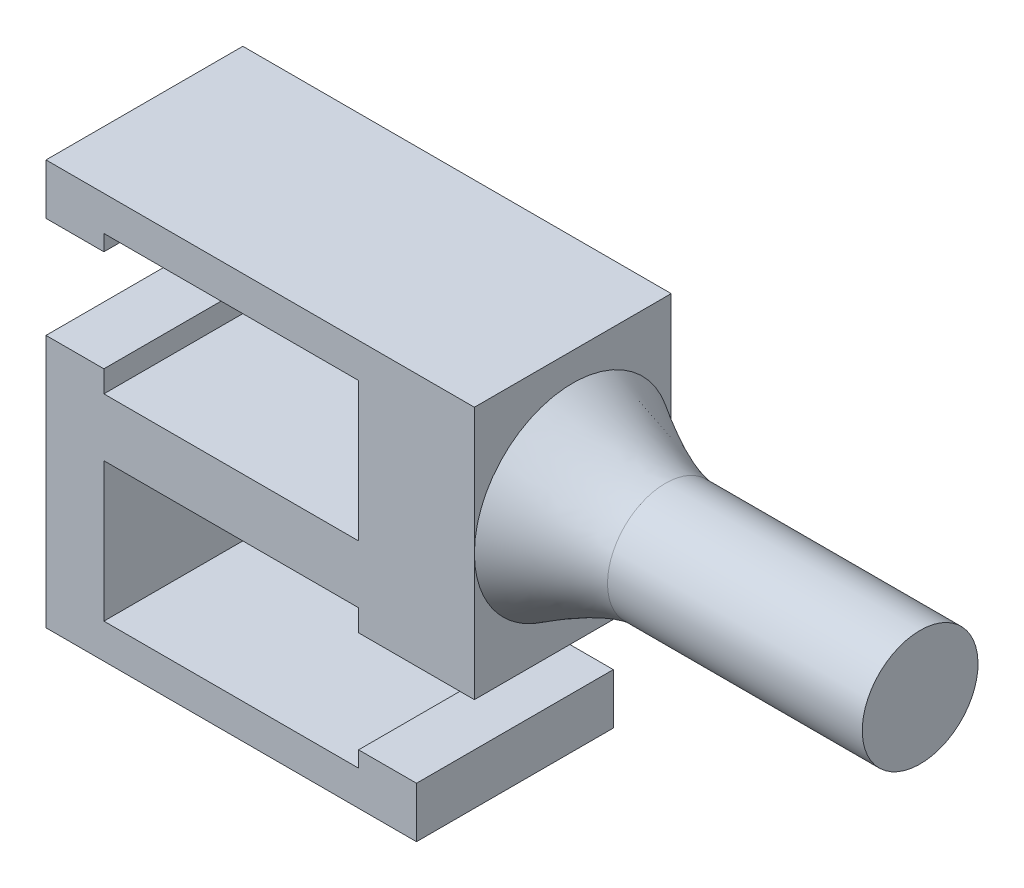
ISO-10303-21;
HEADER;
FILE_DESCRIPTION(('STEP AP214'),'2;1');
FILE_NAME('part.step','',(''),(''),'','','');
FILE_SCHEMA(('AUTOMOTIVE_DESIGN { 1 0 10303 214 1 1 1 1 }'));
ENDSEC;
DATA;
#1=APPLICATION_CONTEXT('core data for automotive mechanical design processes');
#2=APPLICATION_PROTOCOL_DEFINITION('international standard','automotive_design',2000,#1);
#3=PRODUCT_CONTEXT('',#1,'mechanical');
#4=PRODUCT('Part','Part','',(#3));
#5=PRODUCT_RELATED_PRODUCT_CATEGORY('part','',(#4));
#6=PRODUCT_DEFINITION_FORMATION('','',#4);
#7=PRODUCT_DEFINITION_CONTEXT('part definition',#1,'design');
#8=PRODUCT_DEFINITION('design','',#6,#7);
#9=PRODUCT_DEFINITION_SHAPE('','',#8);
#10=(LENGTH_UNIT() NAMED_UNIT(*) SI_UNIT(.MILLI.,.METRE.));
#11=(NAMED_UNIT(*) PLANE_ANGLE_UNIT() SI_UNIT($,.RADIAN.));
#12=(NAMED_UNIT(*) SI_UNIT($,.STERADIAN.) SOLID_ANGLE_UNIT());
#13=UNCERTAINTY_MEASURE_WITH_UNIT(LENGTH_MEASURE(1.E-05),#10,'distance_accuracy_value','');
#14=(GEOMETRIC_REPRESENTATION_CONTEXT(3) GLOBAL_UNCERTAINTY_ASSIGNED_CONTEXT((#13)) GLOBAL_UNIT_ASSIGNED_CONTEXT((#10,
#11,#12)) REPRESENTATION_CONTEXT('',''));
#15=CARTESIAN_POINT('',(0.,0.,0.));
#16=DIRECTION('',(0.,0.,1.));
#17=DIRECTION('',(1.,0.,0.));
#18=AXIS2_PLACEMENT_3D('',#15,#16,#17);
#19=CARTESIAN_POINT('',(21.1122382547684,0.,0.));
#20=DIRECTION('',(1.,0.,0.));
#21=DIRECTION('',(0.,1.,0.));
#22=AXIS2_PLACEMENT_3D('',#19,#20,#21);
#23=PLANE('',#22);
#24=DIRECTION('',(0.,1.,0.));
#25=VECTOR('',#24,1.);
#26=CARTESIAN_POINT('',(21.1122382547684,75.9799365132959,32.));
#27=LINE('',#26,#25);
#28=CARTESIAN_POINT('',(21.1122382547684,54.1049365132959,32.));
#29=VERTEX_POINT('',#28);
#30=CARTESIAN_POINT('',(21.1122382547684,65.0421631936669,32.));
#31=VERTEX_POINT('',#30);
#32=EDGE_CURVE('E222',#29,#31,#27,.T.);
#33=ORIENTED_EDGE('',*,*,#32,.F.);
#34=DIRECTION('',(0.,0.,1.));
#35=VECTOR('',#34,1.);
#36=CARTESIAN_POINT('',(21.1122382547684,54.1049365132959,15.));
#37=LINE('',#36,#35);
#38=CARTESIAN_POINT('',(21.1122382547684,54.1049365132959,15.));
#39=VERTEX_POINT('',#38);
#40=EDGE_CURVE('E205',#39,#29,#37,.T.);
#41=ORIENTED_EDGE('',*,*,#40,.F.);
#42=DIRECTION('',(0.,-1.,0.));
#43=VECTOR('',#42,1.);
#44=CARTESIAN_POINT('',(21.1122382547684,75.9799365132959,15.));
#45=LINE('',#44,#43);
#46=CARTESIAN_POINT('',(21.1122382547684,65.0427098329382,15.));
#47=VERTEX_POINT('',#46);
#48=EDGE_CURVE('E199',#47,#39,#45,.T.);
#49=ORIENTED_EDGE('',*,*,#48,.F.);
#50=CARTESIAN_POINT('',(21.1122382547684,72.8146764351576,20.0587376448433));
#51=CARTESIAN_POINT('',(21.1122382547684,79.697201145471,35.6032174885667));
#52=CARTESIAN_POINT('',(21.1122382547684,64.1527213017475,42.4857421988802));
#53=CARTESIAN_POINT('',(21.1122382547684,57.2701965914341,26.9412623551567));
#54=CARTESIAN_POINT('',(21.1122382547684,50.3876718811207,11.3967825114333));
#55=CARTESIAN_POINT('',(21.1122382547684,65.9321517248442,4.51425780111984));
#56=CARTESIAN_POINT('',(21.1122382547684,72.8146764351576,20.0587376448433));
#57=(BOUNDED_CURVE() B_SPLINE_CURVE(3,(#50,#51,#52,#53,#54,#55,#56),.UNSPECIFIED.,.T.,
.F.) B_SPLINE_CURVE_WITH_KNOTS((4,3,4),(0.,0.5,1.),
.UNSPECIFIED.) CURVE() GEOMETRIC_REPRESENTATION_ITEM() RATIONAL_B_SPLINE_CURVE((1.,
0.333333333333333,0.333333333333333,1.,0.333333333333333,0.333333333333333,1.)) REPRESENTATION_ITEM(''));
#58=EDGE_CURVE('E191',#47,#31,#57,.F.);
#59=ORIENTED_EDGE('',*,*,#58,.T.);
#60=EDGE_LOOP('',(#33,#41,#49,#59));
#61=FACE_BOUND('',#60,.T.);
#62=ADVANCED_FACE('F41',(#61),#23,.T.);
#63=CARTESIAN_POINT('',(21.1122382547684,75.9799365132959,15.));
#64=VERTEX_POINT('',#63);
#65=EDGE_CURVE('E187',#64,#47,#45,.T.);
#66=ORIENTED_EDGE('',*,*,#65,.F.);
#67=DIRECTION('',(0.,0.,-1.));
#68=VECTOR('',#67,1.);
#69=CARTESIAN_POINT('',(21.1122382547684,75.9799365132959,15.));
#70=LINE('',#69,#68);
#71=CARTESIAN_POINT('',(21.1122382547684,75.9799365132959,32.));
#72=VERTEX_POINT('',#71);
#73=EDGE_CURVE('E231',#72,#64,#70,.T.);
#74=ORIENTED_EDGE('',*,*,#73,.F.);
#75=EDGE_CURVE('E189',#31,#72,#27,.T.);
#76=ORIENTED_EDGE('',*,*,#75,.F.);
#77=CARTESIAN_POINT('',(21.1122382547684,65.0424365132959,23.5));
#78=DIRECTION('',(-1.,0.,0.));
#79=DIRECTION('',(0.,1.,0.));
#80=AXIS2_PLACEMENT_3D('',#77,#78,#79);
#81=CIRCLE('',#80,8.49999999999999);
#82=EDGE_CURVE('E57',#31,#47,#81,.T.);
#83=ORIENTED_EDGE('',*,*,#82,.T.);
#84=EDGE_LOOP('',(#66,#74,#76,#83));
#85=FACE_BOUND('',#84,.T.);
#86=ADVANCED_FACE('F185',(#85),#23,.T.);
#87=CARTESIAN_POINT('',(16.1122382547684,0.,35.));
#88=DIRECTION('',(-1.,0.,0.));
#89=DIRECTION('',(0.,-1.,0.));
#90=AXIS2_PLACEMENT_3D('',#87,#88,#89);
#91=PLANE('',#90);
#92=DIRECTION('',(0.,0.,-1.));
#93=VECTOR('',#92,1.);
#94=CARTESIAN_POINT('',(16.1122382547684,40.9799365132959,35.));
#95=LINE('',#94,#93);
#96=CARTESIAN_POINT('',(16.1122382547684,40.9799365132959,32.));
#97=VERTEX_POINT('',#96);
#98=CARTESIAN_POINT('',(16.1122382547684,40.9799365132959,15.));
#99=VERTEX_POINT('',#98);
#100=EDGE_CURVE('E50',#97,#99,#95,.T.);
#101=ORIENTED_EDGE('',*,*,#100,.T.);
#102=DIRECTION('',(0.,1.,0.));
#103=VECTOR('',#102,1.);
#104=CARTESIAN_POINT('',(16.1122382547684,75.9799365132959,15.));
#105=LINE('',#104,#103);
#106=CARTESIAN_POINT('',(16.1122382547684,45.3549365132959,15.));
#107=VERTEX_POINT('',#106);
#108=EDGE_CURVE('E406',#99,#107,#105,.T.);
#109=ORIENTED_EDGE('',*,*,#108,.T.);
#110=DIRECTION('',(0.,0.,1.));
#111=VECTOR('',#110,1.);
#112=CARTESIAN_POINT('',(16.1122382547684,45.3549365132959,35.));
#113=LINE('',#112,#111);
#114=CARTESIAN_POINT('',(16.1122382547684,45.3549365132959,32.));
#115=VERTEX_POINT('',#114);
#116=EDGE_CURVE('E382',#107,#115,#113,.T.);
#117=ORIENTED_EDGE('',*,*,#116,.T.);
#118=DIRECTION('',(0.,1.,0.));
#119=VECTOR('',#118,1.);
#120=CARTESIAN_POINT('',(16.1122382547684,75.9799365132959,32.));
#121=LINE('',#120,#119);
#122=EDGE_CURVE('E475',#97,#115,#121,.T.);
#123=ORIENTED_EDGE('',*,*,#122,.F.);
#124=EDGE_LOOP('',(#101,#109,#117,#123));
#125=FACE_BOUND('',#124,.T.);
#126=ADVANCED_FACE('F287',(#125),#91,.F.);
#127=CARTESIAN_POINT('',(11.1122380163498,0.,35.));
#128=DIRECTION('',(-1.,0.,0.));
#129=DIRECTION('',(0.,0.,-1.));
#130=AXIS2_PLACEMENT_3D('',#127,#128,#129);
#131=PLANE('',#130);
#132=DIRECTION('',(0.,1.,0.));
#133=VECTOR('',#132,1.);
#134=CARTESIAN_POINT('',(11.1122380163498,0.,32.));
#135=LINE('',#134,#133);
#136=CARTESIAN_POINT('',(11.1122380163498,43.9799365132959,32.));
#137=VERTEX_POINT('',#136);
#138=CARTESIAN_POINT('',(11.1122380163498,45.3549365132959,32.));
#139=VERTEX_POINT('',#138);
#140=EDGE_CURVE('E340',#137,#139,#135,.T.);
#141=ORIENTED_EDGE('',*,*,#140,.T.);
#142=DIRECTION('',(0.,0.,1.));
#143=VECTOR('',#142,1.);
#144=CARTESIAN_POINT('',(11.1122380163498,45.3549365132959,35.));
#145=LINE('',#144,#143);
#146=CARTESIAN_POINT('',(11.1122380163498,45.3549365132959,15.));
#147=VERTEX_POINT('',#146);
#148=EDGE_CURVE('E383',#147,#139,#145,.T.);
#149=ORIENTED_EDGE('',*,*,#148,.F.);
#150=DIRECTION('',(0.,-1.,0.));
#151=VECTOR('',#150,1.);
#152=CARTESIAN_POINT('',(11.1122380163498,0.,15.));
#153=LINE('',#152,#151);
#154=CARTESIAN_POINT('',(11.1122380163498,43.9799365132959,15.));
#155=VERTEX_POINT('',#154);
#156=EDGE_CURVE('E346',#147,#155,#153,.T.);
#157=ORIENTED_EDGE('',*,*,#156,.T.);
#158=DIRECTION('',(0.,0.,-1.));
#159=VECTOR('',#158,1.);
#160=CARTESIAN_POINT('',(11.1122380163498,43.9799365132959,35.));
#161=LINE('',#160,#159);
#162=EDGE_CURVE('E334',#137,#155,#161,.T.);
#163=ORIENTED_EDGE('',*,*,#162,.F.);
#164=EDGE_LOOP('',(#141,#149,#157,#163));
#165=FACE_BOUND('',#164,.T.);
#166=ADVANCED_FACE('F290',(#165),#131,.T.);
#167=CARTESIAN_POINT('',(-10.8877619836502,0.,35.));
#168=DIRECTION('',(-1.,0.,0.));
#169=DIRECTION('',(0.,-1.,0.));
#170=AXIS2_PLACEMENT_3D('',#167,#168,#169);
#171=PLANE('',#170);
#172=DIRECTION('',(0.,0.,-1.));
#173=VECTOR('',#172,1.);
#174=CARTESIAN_POINT('',(-10.8877619836502,60.9799365132958,35.));
#175=LINE('',#174,#173);
#176=CARTESIAN_POINT('',(-10.8877619836502,60.9799365132958,32.));
#177=VERTEX_POINT('',#176);
#178=CARTESIAN_POINT('',(-10.8877619836502,60.9799365132959,15.));
#179=VERTEX_POINT('',#178);
#180=EDGE_CURVE('E451',#177,#179,#175,.T.);
#181=ORIENTED_EDGE('',*,*,#180,.T.);
#182=DIRECTION('',(0.,-1.,0.));
#183=VECTOR('',#182,1.);
#184=CARTESIAN_POINT('',(-10.8877619836502,0.,15.));
#185=LINE('',#184,#183);
#186=CARTESIAN_POINT('',(-10.8877619836502,62.8549365132958,15.));
#187=VERTEX_POINT('',#186);
#188=EDGE_CURVE('E439',#187,#179,#185,.T.);
#189=ORIENTED_EDGE('',*,*,#188,.F.);
#190=DIRECTION('',(0.,0.,-1.));
#191=VECTOR('',#190,1.);
#192=CARTESIAN_POINT('',(-10.8877619836502,62.8549365132958,15.));
#193=LINE('',#192,#191);
#194=CARTESIAN_POINT('',(-10.8877619836502,62.8549365132958,32.));
#195=VERTEX_POINT('',#194);
#196=EDGE_CURVE('E393',#195,#187,#193,.T.);
#197=ORIENTED_EDGE('',*,*,#196,.F.);
#198=DIRECTION('',(0.,1.,0.));
#199=VECTOR('',#198,1.);
#200=CARTESIAN_POINT('',(-10.8877619836502,0.,32.));
#201=LINE('',#200,#199);
#202=EDGE_CURVE('E367',#177,#195,#201,.T.);
#203=ORIENTED_EDGE('',*,*,#202,.F.);
#204=EDGE_LOOP('',(#181,#189,#197,#203));
#205=FACE_BOUND('',#204,.T.);
#206=ADVANCED_FACE('F319',(#205),#171,.F.);
#207=CARTESIAN_POINT('',(-15.8877622220688,0.,35.));
#208=DIRECTION('',(-1.,0.,0.));
#209=DIRECTION('',(0.,-1.,0.));
#210=AXIS2_PLACEMENT_3D('',#207,#208,#209);
#211=PLANE('',#210);
#212=DIRECTION('',(0.,1.,0.));
#213=VECTOR('',#212,1.);
#214=CARTESIAN_POINT('',(-15.8877622220688,75.9799365132959,32.));
#215=LINE('',#214,#213);
#216=CARTESIAN_POINT('',(-15.8877622220688,40.9799365132959,32.));
#217=VERTEX_POINT('',#216);
#218=CARTESIAN_POINT('',(-15.8877622220688,62.8549365132958,32.));
#219=VERTEX_POINT('',#218);
#220=EDGE_CURVE('E471',#217,#219,#215,.T.);
#221=ORIENTED_EDGE('',*,*,#220,.T.);
#222=DIRECTION('',(0.,0.,1.));
#223=VECTOR('',#222,1.);
#224=CARTESIAN_POINT('',(-15.8877622220688,62.8549365132958,15.));
#225=LINE('',#224,#223);
#226=CARTESIAN_POINT('',(-15.8877622220688,62.8549365132958,15.));
#227=VERTEX_POINT('',#226);
#228=EDGE_CURVE('E399',#227,#219,#225,.T.);
#229=ORIENTED_EDGE('',*,*,#228,.F.);
#230=DIRECTION('',(0.,1.,0.));
#231=VECTOR('',#230,1.);
#232=CARTESIAN_POINT('',(-15.8877622220688,75.9799365132959,15.));
#233=LINE('',#232,#231);
#234=CARTESIAN_POINT('',(-15.8877622220688,40.9799365132959,15.));
#235=VERTEX_POINT('',#234);
#236=EDGE_CURVE('E410',#235,#227,#233,.T.);
#237=ORIENTED_EDGE('',*,*,#236,.F.);
#238=DIRECTION('',(0.,0.,-1.));
#239=VECTOR('',#238,1.);
#240=CARTESIAN_POINT('',(-15.8877622220688,40.9799365132959,35.));
#241=LINE('',#240,#239);
#242=EDGE_CURVE('E446',#217,#235,#241,.T.);
#243=ORIENTED_EDGE('',*,*,#242,.F.);
#244=EDGE_LOOP('',(#221,#229,#237,#243));
#245=FACE_BOUND('',#244,.T.);
#246=ADVANCED_FACE('F286',(#245),#211,.T.);
#247=CARTESIAN_POINT('',(-15.8877622220688,75.9799365132959,15.));
#248=DIRECTION('',(0.,0.,1.));
#249=DIRECTION('',(0.,1.,0.));
#250=AXIS2_PLACEMENT_3D('',#247,#248,#249);
#251=PLANE('',#250);
#252=ORIENTED_EDGE('',*,*,#108,.F.);
#253=DIRECTION('',(1.,0.,0.));
#254=VECTOR('',#253,1.);
#255=CARTESIAN_POINT('',(-15.8877622220688,40.9799365132959,15.));
#256=LINE('',#255,#254);
#257=EDGE_CURVE('E416',#235,#99,#256,.T.);
#258=ORIENTED_EDGE('',*,*,#257,.F.);
#259=ORIENTED_EDGE('',*,*,#236,.T.);
#260=DIRECTION('',(-1.,0.,0.));
#261=VECTOR('',#260,1.);
#262=CARTESIAN_POINT('',(16.1132382547684,62.8549365132958,15.));
#263=LINE('',#262,#261);
#264=EDGE_CURVE('E402',#187,#227,#263,.T.);
#265=ORIENTED_EDGE('',*,*,#264,.F.);
#266=ORIENTED_EDGE('',*,*,#188,.T.);
#267=DIRECTION('',(1.,0.,0.));
#268=VECTOR('',#267,1.);
#269=CARTESIAN_POINT('',(0.,60.9799365132959,15.));
#270=LINE('',#269,#268);
#271=CARTESIAN_POINT('',(11.1122380163498,60.9799365132958,15.));
#272=VERTEX_POINT('',#271);
#273=EDGE_CURVE('E436',#179,#272,#270,.T.);
#274=ORIENTED_EDGE('',*,*,#273,.T.);
#275=DIRECTION('',(0.,-1.,0.));
#276=VECTOR('',#275,1.);
#277=CARTESIAN_POINT('',(11.1122380163498,0.,15.));
#278=LINE('',#277,#276);
#279=CARTESIAN_POINT('',(11.1122380163498,72.9799365132958,15.));
#280=VERTEX_POINT('',#279);
#281=EDGE_CURVE('E433',#280,#272,#278,.T.);
#282=ORIENTED_EDGE('',*,*,#281,.F.);
#283=DIRECTION('',(-1.,4.06395371900136E-09,0.));
#284=VECTOR('',#283,1.);
#285=CARTESIAN_POINT('',(2.96587084589218E-07,72.9799365584555,15.));
#286=LINE('',#285,#284);
#287=CARTESIAN_POINT('',(-10.8877619836502,72.9799366027028,15.));
#288=VERTEX_POINT('',#287);
#289=EDGE_CURVE('E430',#280,#288,#286,.T.);
#290=ORIENTED_EDGE('',*,*,#289,.T.);
#291=CARTESIAN_POINT('',(-10.8877619836502,71.6049365132959,15.));
#292=VERTEX_POINT('',#291);
#293=EDGE_CURVE('E440',#288,#292,#185,.T.);
#294=ORIENTED_EDGE('',*,*,#293,.T.);
#295=DIRECTION('',(-1.,0.,0.));
#296=VECTOR('',#295,1.);
#297=CARTESIAN_POINT('',(16.1132382547684,71.6049365132959,15.));
#298=LINE('',#297,#296);
#299=CARTESIAN_POINT('',(-15.8877622220688,71.6049365132959,15.));
#300=VERTEX_POINT('',#299);
#301=EDGE_CURVE('E398',#292,#300,#298,.T.);
#302=ORIENTED_EDGE('',*,*,#301,.T.);
#303=CARTESIAN_POINT('',(-15.8877622220688,75.9799365132959,15.));
#304=VERTEX_POINT('',#303);
#305=EDGE_CURVE('E413',#300,#304,#233,.T.);
#306=ORIENTED_EDGE('',*,*,#305,.T.);
#307=DIRECTION('',(1.,0.,0.));
#308=VECTOR('',#307,1.);
#309=CARTESIAN_POINT('',(-15.8877622220688,75.9799365132959,15.));
#310=LINE('',#309,#308);
#311=EDGE_CURVE('E203',#304,#64,#310,.T.);
#312=ORIENTED_EDGE('',*,*,#311,.T.);
#313=ORIENTED_EDGE('',*,*,#65,.T.);
#314=ORIENTED_EDGE('',*,*,#48,.T.);
#315=DIRECTION('',(1.,0.,0.));
#316=VECTOR('',#315,1.);
#317=CARTESIAN_POINT('',(-15.8887622220688,54.1049365132958,15.));
#318=LINE('',#317,#316);
#319=CARTESIAN_POINT('',(11.1122380163498,54.1049365132959,15.));
#320=VERTEX_POINT('',#319);
#321=EDGE_CURVE('E389',#320,#39,#318,.T.);
#322=ORIENTED_EDGE('',*,*,#321,.F.);
#323=CARTESIAN_POINT('',(11.1122380163498,55.9799365132959,15.));
#324=VERTEX_POINT('',#323);
#325=EDGE_CURVE('E422',#324,#320,#153,.T.);
#326=ORIENTED_EDGE('',*,*,#325,.F.);
#327=DIRECTION('',(-1.,0.,0.));
#328=VECTOR('',#327,1.);
#329=CARTESIAN_POINT('',(0.,55.9799365132959,15.));
#330=LINE('',#329,#328);
#331=CARTESIAN_POINT('',(-10.8877619836502,55.9799365132959,15.));
#332=VERTEX_POINT('',#331);
#333=EDGE_CURVE('E418',#324,#332,#330,.T.);
#334=ORIENTED_EDGE('',*,*,#333,.T.);
#335=DIRECTION('',(0.,-1.,0.));
#336=VECTOR('',#335,1.);
#337=CARTESIAN_POINT('',(-10.8877619836502,0.,15.));
#338=LINE('',#337,#336);
#339=CARTESIAN_POINT('',(-10.8877619836502,43.9799365132959,15.));
#340=VERTEX_POINT('',#339);
#341=EDGE_CURVE('E427',#332,#340,#338,.T.);
#342=ORIENTED_EDGE('',*,*,#341,.T.);
#343=DIRECTION('',(-1.,0.,0.));
#344=VECTOR('',#343,1.);
#345=CARTESIAN_POINT('',(0.,43.9799365132959,15.));
#346=LINE('',#345,#344);
#347=EDGE_CURVE('E425',#155,#340,#346,.T.);
#348=ORIENTED_EDGE('',*,*,#347,.F.);
#349=ORIENTED_EDGE('',*,*,#156,.F.);
#350=DIRECTION('',(1.,0.,0.));
#351=VECTOR('',#350,1.);
#352=CARTESIAN_POINT('',(-15.8887622220688,45.3549365132958,15.));
#353=LINE('',#352,#351);
#354=EDGE_CURVE('E391',#147,#107,#353,.T.);
#355=ORIENTED_EDGE('',*,*,#354,.T.);
#356=EDGE_LOOP('',(#252,#258,#259,#265,#266,#274,#282,#290,#294,#302,#306,#312,#313,#314,#322,
#326,#334,#342,#348,#349,#355));
#357=FACE_BOUND('',#356,.T.);
#358=ADVANCED_FACE('F196',(#357),#251,.F.);
#359=CARTESIAN_POINT('',(0.,75.9799365132959,35.));
#360=DIRECTION('',(0.,1.,0.));
#361=DIRECTION('',(0.,0.,-1.));
#362=AXIS2_PLACEMENT_3D('',#359,#360,#361);
#363=PLANE('',#362);
#364=DIRECTION('',(-1.,0.,0.));
#365=VECTOR('',#364,1.);
#366=CARTESIAN_POINT('',(16.1122382547684,75.9799365132959,32.));
#367=LINE('',#366,#365);
#368=CARTESIAN_POINT('',(-15.8877622220688,75.9799365132959,32.));
#369=VERTEX_POINT('',#368);
#370=EDGE_CURVE('E350',#72,#369,#367,.T.);
#371=ORIENTED_EDGE('',*,*,#370,.F.);
#372=ORIENTED_EDGE('',*,*,#73,.T.);
#373=ORIENTED_EDGE('',*,*,#311,.F.);
#374=DIRECTION('',(0.,0.,-1.));
#375=VECTOR('',#374,1.);
#376=CARTESIAN_POINT('',(-15.8877622220688,75.9799365132959,35.));
#377=LINE('',#376,#375);
#378=EDGE_CURVE('E449',#369,#304,#377,.T.);
#379=ORIENTED_EDGE('',*,*,#378,.F.);
#380=EDGE_LOOP('',(#371,#372,#373,#379));
#381=FACE_BOUND('',#380,.T.);
#382=ADVANCED_FACE('F285',(#381),#363,.T.);
#383=CARTESIAN_POINT('',(0.,40.9799365132959,35.));
#384=DIRECTION('',(0.,1.,0.));
#385=DIRECTION('',(0.,0.,-1.));
#386=AXIS2_PLACEMENT_3D('',#383,#384,#385);
#387=PLANE('',#386);
#388=ORIENTED_EDGE('',*,*,#242,.T.);
#389=ORIENTED_EDGE('',*,*,#257,.T.);
#390=ORIENTED_EDGE('',*,*,#100,.F.);
#391=DIRECTION('',(-1.,0.,0.));
#392=VECTOR('',#391,1.);
#393=CARTESIAN_POINT('',(16.1122382547684,40.9799365132959,32.));
#394=LINE('',#393,#392);
#395=EDGE_CURVE('E353',#97,#217,#394,.T.);
#396=ORIENTED_EDGE('',*,*,#395,.T.);
#397=EDGE_LOOP('',(#388,#389,#390,#396));
#398=FACE_BOUND('',#397,.T.);
#399=ADVANCED_FACE('F292',(#398),#387,.F.);
#400=DIRECTION('',(0.,0.,-1.));
#401=VECTOR('',#400,1.);
#402=CARTESIAN_POINT('',(-10.8877619836502,71.6049365132959,15.));
#403=LINE('',#402,#401);
#404=CARTESIAN_POINT('',(-10.8877619836502,71.6049365132959,32.));
#405=VERTEX_POINT('',#404);
#406=EDGE_CURVE('E397',#405,#292,#403,.T.);
#407=ORIENTED_EDGE('',*,*,#406,.T.);
#408=ORIENTED_EDGE('',*,*,#293,.F.);
#409=DIRECTION('',(0.,0.,-1.));
#410=VECTOR('',#409,1.);
#411=CARTESIAN_POINT('',(-10.8877619836502,72.9799366027028,35.));
#412=LINE('',#411,#410);
#413=CARTESIAN_POINT('',(-10.8877619836502,72.9799366027028,32.));
#414=VERTEX_POINT('',#413);
#415=EDGE_CURVE('E458',#414,#288,#412,.T.);
#416=ORIENTED_EDGE('',*,*,#415,.F.);
#417=DIRECTION('',(0.,1.,0.));
#418=VECTOR('',#417,1.);
#419=CARTESIAN_POINT('',(-10.8877619836502,0.,32.));
#420=LINE('',#419,#418);
#421=EDGE_CURVE('E377',#405,#414,#420,.T.);
#422=ORIENTED_EDGE('',*,*,#421,.F.);
#423=EDGE_LOOP('',(#407,#408,#416,#422));
#424=FACE_BOUND('',#423,.T.);
#425=ADVANCED_FACE('F295',(#424),#171,.F.);
#426=CARTESIAN_POINT('',(0.,60.9799365132959,35.));
#427=DIRECTION('',(0.,-1.,0.));
#428=DIRECTION('',(1.,0.,0.));
#429=AXIS2_PLACEMENT_3D('',#426,#427,#428);
#430=PLANE('',#429);
#431=DIRECTION('',(0.,0.,-1.));
#432=VECTOR('',#431,1.);
#433=CARTESIAN_POINT('',(11.1122380163498,60.9799365132958,35.));
#434=LINE('',#433,#432);
#435=CARTESIAN_POINT('',(11.1122380163498,60.9799365132958,32.));
#436=VERTEX_POINT('',#435);
#437=EDGE_CURVE('E454',#436,#272,#434,.T.);
#438=ORIENTED_EDGE('',*,*,#437,.T.);
#439=ORIENTED_EDGE('',*,*,#273,.F.);
#440=ORIENTED_EDGE('',*,*,#180,.F.);
#441=DIRECTION('',(-1.,0.,0.));
#442=VECTOR('',#441,1.);
#443=CARTESIAN_POINT('',(0.,60.9799365132959,32.));
#444=LINE('',#443,#442);
#445=EDGE_CURVE('E370',#436,#177,#444,.T.);
#446=ORIENTED_EDGE('',*,*,#445,.F.);
#447=EDGE_LOOP('',(#438,#439,#440,#446));
#448=FACE_BOUND('',#447,.T.);
#449=ADVANCED_FACE('F303',(#448),#430,.F.);
#450=DIRECTION('',(0.,1.,0.));
#451=VECTOR('',#450,1.);
#452=CARTESIAN_POINT('',(11.1122380163498,0.,32.));
#453=LINE('',#452,#451);
#454=CARTESIAN_POINT('',(11.1122380163498,72.9799365132958,32.));
#455=VERTEX_POINT('',#454);
#456=EDGE_CURVE('E372',#436,#455,#453,.T.);
#457=ORIENTED_EDGE('',*,*,#456,.T.);
#458=DIRECTION('',(0.,0.,-1.));
#459=VECTOR('',#458,1.);
#460=CARTESIAN_POINT('',(11.1122380163498,72.9799365132958,35.));
#461=LINE('',#460,#459);
#462=EDGE_CURVE('E456',#455,#280,#461,.T.);
#463=ORIENTED_EDGE('',*,*,#462,.T.);
#464=ORIENTED_EDGE('',*,*,#281,.T.);
#465=ORIENTED_EDGE('',*,*,#437,.F.);
#466=EDGE_LOOP('',(#457,#463,#464,#465));
#467=FACE_BOUND('',#466,.T.);
#468=ADVANCED_FACE('F306',(#467),#131,.T.);
#469=DIRECTION('',(0.,0.,-1.));
#470=VECTOR('',#469,1.);
#471=CARTESIAN_POINT('',(-10.8877619836502,43.9799365132959,35.));
#472=LINE('',#471,#470);
#473=CARTESIAN_POINT('',(-10.8877619836502,43.9799365132959,32.));
#474=VERTEX_POINT('',#473);
#475=EDGE_CURVE('E336',#474,#340,#472,.T.);
#476=ORIENTED_EDGE('',*,*,#475,.T.);
#477=ORIENTED_EDGE('',*,*,#341,.F.);
#478=DIRECTION('',(0.,0.,-1.));
#479=VECTOR('',#478,1.);
#480=CARTESIAN_POINT('',(-10.8877619836502,55.9799365132959,35.));
#481=LINE('',#480,#479);
#482=CARTESIAN_POINT('',(-10.8877619836502,55.9799365132959,32.));
#483=VERTEX_POINT('',#482);
#484=EDGE_CURVE('E443',#483,#332,#481,.T.);
#485=ORIENTED_EDGE('',*,*,#484,.F.);
#486=DIRECTION('',(0.,1.,0.));
#487=VECTOR('',#486,1.);
#488=CARTESIAN_POINT('',(-10.8877619836502,0.,32.));
#489=LINE('',#488,#487);
#490=EDGE_CURVE('E339',#474,#483,#489,.T.);
#491=ORIENTED_EDGE('',*,*,#490,.F.);
#492=EDGE_LOOP('',(#476,#477,#485,#491));
#493=FACE_BOUND('',#492,.T.);
#494=ADVANCED_FACE('F310',(#493),#171,.F.);
#495=CARTESIAN_POINT('',(0.,43.9799365132959,35.));
#496=DIRECTION('',(0.,1.,0.));
#497=DIRECTION('',(0.,0.,-1.));
#498=AXIS2_PLACEMENT_3D('',#495,#496,#497);
#499=PLANE('',#498);
#500=DIRECTION('',(1.,0.,0.));
#501=VECTOR('',#500,1.);
#502=CARTESIAN_POINT('',(0.,43.9799365132959,32.));
#503=LINE('',#502,#501);
#504=EDGE_CURVE('E331',#474,#137,#503,.T.);
#505=ORIENTED_EDGE('',*,*,#504,.T.);
#506=ORIENTED_EDGE('',*,*,#162,.T.);
#507=ORIENTED_EDGE('',*,*,#347,.T.);
#508=ORIENTED_EDGE('',*,*,#475,.F.);
#509=EDGE_LOOP('',(#505,#506,#507,#508));
#510=FACE_BOUND('',#509,.T.);
#511=ADVANCED_FACE('F320',(#510),#499,.T.);
#512=DIRECTION('',(0.,1.,0.));
#513=VECTOR('',#512,1.);
#514=CARTESIAN_POINT('',(11.1122380163498,0.,32.));
#515=LINE('',#514,#513);
#516=CARTESIAN_POINT('',(11.1122380163498,54.1049365132959,32.));
#517=VERTEX_POINT('',#516);
#518=CARTESIAN_POINT('',(11.1122380163498,55.9799365132959,32.));
#519=VERTEX_POINT('',#518);
#520=EDGE_CURVE('E360',#517,#519,#515,.T.);
#521=ORIENTED_EDGE('',*,*,#520,.T.);
#522=DIRECTION('',(0.,0.,-1.));
#523=VECTOR('',#522,1.);
#524=CARTESIAN_POINT('',(11.1122380163498,55.9799365132959,35.));
#525=LINE('',#524,#523);
#526=EDGE_CURVE('E347',#519,#324,#525,.T.);
#527=ORIENTED_EDGE('',*,*,#526,.T.);
#528=ORIENTED_EDGE('',*,*,#325,.T.);
#529=DIRECTION('',(0.,0.,-1.));
#530=VECTOR('',#529,1.);
#531=CARTESIAN_POINT('',(11.1122380163498,54.1049365132959,35.));
#532=LINE('',#531,#530);
#533=EDGE_CURVE('E385',#517,#320,#532,.T.);
#534=ORIENTED_EDGE('',*,*,#533,.F.);
#535=EDGE_LOOP('',(#521,#527,#528,#534));
#536=FACE_BOUND('',#535,.T.);
#537=ADVANCED_FACE('F312',(#536),#131,.T.);
#538=CARTESIAN_POINT('',(2.96587084589218E-07,72.9799365584555,35.));
#539=DIRECTION('',(4.06395371900136E-09,1.,0.));
#540=DIRECTION('',(-1.,4.06395371900136E-09,0.));
#541=AXIS2_PLACEMENT_3D('',#538,#539,#540);
#542=PLANE('',#541);
#543=ORIENTED_EDGE('',*,*,#415,.T.);
#544=ORIENTED_EDGE('',*,*,#289,.F.);
#545=ORIENTED_EDGE('',*,*,#462,.F.);
#546=DIRECTION('',(1.,-4.06395371900136E-09,0.));
#547=VECTOR('',#546,1.);
#548=CARTESIAN_POINT('',(2.96587084589218E-07,72.9799365584555,32.));
#549=LINE('',#548,#547);
#550=EDGE_CURVE('E375',#414,#455,#549,.T.);
#551=ORIENTED_EDGE('',*,*,#550,.F.);
#552=EDGE_LOOP('',(#543,#544,#545,#551));
#553=FACE_BOUND('',#552,.T.);
#554=ADVANCED_FACE('F313',(#553),#542,.F.);
#555=CARTESIAN_POINT('',(0.,55.9799365132959,35.));
#556=DIRECTION('',(0.,1.,0.));
#557=DIRECTION('',(0.,0.,-1.));
#558=AXIS2_PLACEMENT_3D('',#555,#556,#557);
#559=PLANE('',#558);
#560=ORIENTED_EDGE('',*,*,#484,.T.);
#561=ORIENTED_EDGE('',*,*,#333,.F.);
#562=ORIENTED_EDGE('',*,*,#526,.F.);
#563=DIRECTION('',(1.,0.,0.));
#564=VECTOR('',#563,1.);
#565=CARTESIAN_POINT('',(0.,55.9799365132959,32.));
#566=LINE('',#565,#564);
#567=EDGE_CURVE('E358',#483,#519,#566,.T.);
#568=ORIENTED_EDGE('',*,*,#567,.F.);
#569=EDGE_LOOP('',(#560,#561,#562,#568));
#570=FACE_BOUND('',#569,.T.);
#571=ADVANCED_FACE('F43',(#570),#559,.F.);
#572=CARTESIAN_POINT('',(-15.8877622220688,71.6049365132959,32.));
#573=VERTEX_POINT('',#572);
#574=EDGE_CURVE('E470',#573,#369,#215,.T.);
#575=ORIENTED_EDGE('',*,*,#574,.T.);
#576=ORIENTED_EDGE('',*,*,#378,.T.);
#577=ORIENTED_EDGE('',*,*,#305,.F.);
#578=DIRECTION('',(0.,0.,1.));
#579=VECTOR('',#578,1.);
#580=CARTESIAN_POINT('',(-15.8877622220688,71.6049365132959,15.));
#581=LINE('',#580,#579);
#582=EDGE_CURVE('E394',#300,#573,#581,.T.);
#583=ORIENTED_EDGE('',*,*,#582,.T.);
#584=EDGE_LOOP('',(#575,#576,#577,#583));
#585=FACE_BOUND('',#584,.T.);
#586=ADVANCED_FACE('F278',(#585),#211,.T.);
#587=CARTESIAN_POINT('',(16.1132382547684,71.6049365132959,15.));
#588=DIRECTION('',(0.,1.,0.));
#589=DIRECTION('',(-1.,0.,0.));
#590=AXIS2_PLACEMENT_3D('',#587,#588,#589);
#591=PLANE('',#590);
#592=ORIENTED_EDGE('',*,*,#582,.F.);
#593=ORIENTED_EDGE('',*,*,#301,.F.);
#594=ORIENTED_EDGE('',*,*,#406,.F.);
#595=DIRECTION('',(1.,0.,0.));
#596=VECTOR('',#595,1.);
#597=CARTESIAN_POINT('',(16.1132382547684,71.6049365132959,32.));
#598=LINE('',#597,#596);
#599=EDGE_CURVE('E380',#573,#405,#598,.T.);
#600=ORIENTED_EDGE('',*,*,#599,.F.);
#601=EDGE_LOOP('',(#592,#593,#594,#600));
#602=FACE_BOUND('',#601,.T.);
#603=ADVANCED_FACE('F275',(#602),#591,.F.);
#604=CARTESIAN_POINT('',(16.1132382547684,62.8549365132958,15.));
#605=DIRECTION('',(0.,1.,0.));
#606=DIRECTION('',(-1.,0.,0.));
#607=AXIS2_PLACEMENT_3D('',#604,#605,#606);
#608=PLANE('',#607);
#609=DIRECTION('',(1.,0.,0.));
#610=VECTOR('',#609,1.);
#611=CARTESIAN_POINT('',(16.1132382547684,62.8549365132958,32.));
#612=LINE('',#611,#610);
#613=EDGE_CURVE('E365',#219,#195,#612,.T.);
#614=ORIENTED_EDGE('',*,*,#613,.T.);
#615=ORIENTED_EDGE('',*,*,#196,.T.);
#616=ORIENTED_EDGE('',*,*,#264,.T.);
#617=ORIENTED_EDGE('',*,*,#228,.T.);
#618=EDGE_LOOP('',(#614,#615,#616,#617));
#619=FACE_BOUND('',#618,.T.);
#620=ADVANCED_FACE('F270',(#619),#608,.T.);
#621=CARTESIAN_POINT('',(-15.8887622220688,54.1049365132958,35.));
#622=DIRECTION('',(0.,1.,0.));
#623=DIRECTION('',(-1.,0.,0.));
#624=AXIS2_PLACEMENT_3D('',#621,#622,#623);
#625=PLANE('',#624);
#626=ORIENTED_EDGE('',*,*,#533,.T.);
#627=ORIENTED_EDGE('',*,*,#321,.T.);
#628=ORIENTED_EDGE('',*,*,#40,.T.);
#629=DIRECTION('',(1.,0.,0.));
#630=VECTOR('',#629,1.);
#631=CARTESIAN_POINT('',(-15.8887622220688,54.1049365132958,32.));
#632=LINE('',#631,#630);
#633=EDGE_CURVE('E363',#517,#29,#632,.T.);
#634=ORIENTED_EDGE('',*,*,#633,.F.);
#635=EDGE_LOOP('',(#626,#627,#628,#634));
#636=FACE_BOUND('',#635,.T.);
#637=ADVANCED_FACE('F267',(#636),#625,.F.);
#638=CARTESIAN_POINT('',(-15.8887622220688,45.3549365132958,35.));
#639=DIRECTION('',(0.,-1.,0.));
#640=DIRECTION('',(1.,0.,0.));
#641=AXIS2_PLACEMENT_3D('',#638,#639,#640);
#642=PLANE('',#641);
#643=ORIENTED_EDGE('',*,*,#116,.F.);
#644=ORIENTED_EDGE('',*,*,#354,.F.);
#645=ORIENTED_EDGE('',*,*,#148,.T.);
#646=DIRECTION('',(-1.,0.,0.));
#647=VECTOR('',#646,1.);
#648=CARTESIAN_POINT('',(-15.8887622220688,45.3549365132958,32.));
#649=LINE('',#648,#647);
#650=EDGE_CURVE('E12',#115,#139,#649,.T.);
#651=ORIENTED_EDGE('',*,*,#650,.F.);
#652=EDGE_LOOP('',(#643,#644,#645,#651));
#653=FACE_BOUND('',#652,.T.);
#654=ADVANCED_FACE('F266',(#653),#642,.F.);
#655=CARTESIAN_POINT('',(16.1122382547684,75.9799365132959,32.));
#656=DIRECTION('',(0.,0.,-1.));
#657=DIRECTION('',(0.,-1.,0.));
#658=AXIS2_PLACEMENT_3D('',#655,#656,#657);
#659=PLANE('',#658);
#660=ORIENTED_EDGE('',*,*,#574,.F.);
#661=ORIENTED_EDGE('',*,*,#599,.T.);
#662=ORIENTED_EDGE('',*,*,#421,.T.);
#663=ORIENTED_EDGE('',*,*,#550,.T.);
#664=ORIENTED_EDGE('',*,*,#456,.F.);
#665=ORIENTED_EDGE('',*,*,#445,.T.);
#666=ORIENTED_EDGE('',*,*,#202,.T.);
#667=ORIENTED_EDGE('',*,*,#613,.F.);
#668=ORIENTED_EDGE('',*,*,#220,.F.);
#669=ORIENTED_EDGE('',*,*,#395,.F.);
#670=ORIENTED_EDGE('',*,*,#122,.T.);
#671=ORIENTED_EDGE('',*,*,#650,.T.);
#672=ORIENTED_EDGE('',*,*,#140,.F.);
#673=ORIENTED_EDGE('',*,*,#504,.F.);
#674=ORIENTED_EDGE('',*,*,#490,.T.);
#675=ORIENTED_EDGE('',*,*,#567,.T.);
#676=ORIENTED_EDGE('',*,*,#520,.F.);
#677=ORIENTED_EDGE('',*,*,#633,.T.);
#678=ORIENTED_EDGE('',*,*,#32,.T.);
#679=ORIENTED_EDGE('',*,*,#75,.T.);
#680=ORIENTED_EDGE('',*,*,#370,.T.);
#681=EDGE_LOOP('',(#660,#661,#662,#663,#664,#665,#666,#667,#668,#669,#670,#671,#672,#673,#674,
#675,#676,#677,#678,#679,#680));
#682=FACE_BOUND('',#681,.T.);
#683=ADVANCED_FACE('F256',(#682),#659,.F.);
#684=CARTESIAN_POINT('',(29.1122382547684,67.0021954546326,18.9000712079587));
#685=CARTESIAN_POINT('',(21.1122382547684,72.8146764351576,20.0587376448433));
#686=CARTESIAN_POINT('',(29.1122382547684,76.2020530387152,22.8195890906322));
#687=CARTESIAN_POINT('',(21.1122382547684,79.697201145471,35.6032174885667));
#688=CARTESIAN_POINT('',(29.1122382547684,72.2825351560417,32.0194466747148));
#689=CARTESIAN_POINT('',(21.1122382547684,64.1527213017475,42.4857421988802));
#690=CARTESIAN_POINT('',(29.1122382547684,63.0826775719591,28.0999287920413));
#691=CARTESIAN_POINT('',(21.1122382547684,57.2701965914341,26.9412623551567));
#692=CARTESIAN_POINT('',(29.1122382547684,53.8828199878765,24.1804109093678));
#693=CARTESIAN_POINT('',(21.1122382547684,50.3876718811207,11.3967825114333));
#694=CARTESIAN_POINT('',(29.1122382547684,57.80233787055,14.9805533252852));
#695=CARTESIAN_POINT('',(21.1122382547684,65.9321517248442,4.51425780111984));
#696=CARTESIAN_POINT('',(29.1122382547684,67.0021954546326,18.9000712079587));
#697=CARTESIAN_POINT('',(21.1122382547684,72.8146764351576,20.0587376448433));
#698=(BOUNDED_SURFACE() B_SPLINE_SURFACE(3,1,((#684,#685),(#686,#687),(#688,#689),(#690,#691),
(#692,#693),(#694,#695),(#696,#697)),.UNSPECIFIED.,.T.,.F.,.F.) B_SPLINE_SURFACE_WITH_KNOTS((4,
3,4),(2,2),(0.,0.5,1.),(0.,1.),
.UNSPECIFIED.) GEOMETRIC_REPRESENTATION_ITEM() RATIONAL_B_SPLINE_SURFACE(((1.,1.),
(0.333333333333333,0.333333333333333),(0.333333333333333,0.333333333333333),(1.,1.),
(0.333333333333333,0.333333333333333),(0.333333333333333,0.333333333333333),(1.,1.))) REPRESENTATION_ITEM('') SURFACE());
#699=CARTESIAN_POINT('',(29.1122382547684,67.0021954546326,18.9000712079587));
#700=CARTESIAN_POINT('',(29.1122382547684,57.80233787055,14.9805533252852));
#701=CARTESIAN_POINT('',(29.1122382547684,53.8828199878765,24.1804109093678));
#702=CARTESIAN_POINT('',(29.1122382547684,63.0826775719591,28.0999287920413));
#703=CARTESIAN_POINT('',(29.1122382547684,72.2825351560417,32.0194466747148));
#704=CARTESIAN_POINT('',(29.1122382547684,76.2020530387152,22.8195890906322));
#705=CARTESIAN_POINT('',(29.1122382547684,67.0021954546326,18.9000712079587));
#706=(BOUNDED_CURVE() B_SPLINE_CURVE(3,(#699,#700,#701,#702,#703,#704,#705),.UNSPECIFIED.,.T.,
.F.) B_SPLINE_CURVE_WITH_KNOTS((4,3,4),(0.,0.5,1.),
.UNSPECIFIED.) CURVE() GEOMETRIC_REPRESENTATION_ITEM() RATIONAL_B_SPLINE_CURVE((1.,
0.333333333333333,0.333333333333333,1.,0.333333333333333,0.333333333333333,1.)) REPRESENTATION_ITEM(''));
#707=CARTESIAN_POINT('',(29.1122382547684,67.0021954546326,18.9000712079587));
#708=VERTEX_POINT('',#707);
#709=EDGE_CURVE('E192',#708,#708,#706,.T.);
#710=ORIENTED_EDGE('',*,*,#709,.T.);
#711=EDGE_LOOP('',(#710));
#712=FACE_BOUND('',#711,.T.);
#713=ORIENTED_EDGE('',*,*,#58,.F.);
#714=ORIENTED_EDGE('',*,*,#82,.F.);
#715=EDGE_LOOP('',(#713,#714));
#716=FACE_BOUND('',#715,.T.);
#717=ADVANCED_FACE('F208',(#712,#716),#698,.F.);
#718=CARTESIAN_POINT('',(51.1122382547684,65.0424365132959,23.5));
#719=DIRECTION('',(1.,0.,0.));
#720=DIRECTION('',(0.,1.,0.));
#721=AXIS2_PLACEMENT_3D('',#718,#719,#720);
#722=PLANE('',#721);
#723=CARTESIAN_POINT('',(51.1122382547684,65.0424365132959,23.5));
#724=DIRECTION('',(-1.,0.,0.));
#725=DIRECTION('',(0.,1.,0.));
#726=AXIS2_PLACEMENT_3D('',#723,#724,#725);
#727=CIRCLE('',#726,5.);
#728=CARTESIAN_POINT('',(51.1122382547684,70.0424365132959,23.5));
#729=VERTEX_POINT('',#728);
#730=EDGE_CURVE('E213',#729,#729,#727,.T.);
#731=ORIENTED_EDGE('',*,*,#730,.F.);
#732=EDGE_LOOP('',(#731));
#733=FACE_BOUND('',#732,.T.);
#734=ADVANCED_FACE('F250',(#733),#722,.T.);
#735=CARTESIAN_POINT('',(51.1122382547684,65.0424365132959,23.5));
#736=DIRECTION('',(-1.,0.,0.));
#737=DIRECTION('',(0.,-1.,0.));
#738=AXIS2_PLACEMENT_3D('',#735,#736,#737);
#739=CYLINDRICAL_SURFACE('',#738,5.);
#740=ORIENTED_EDGE('',*,*,#709,.F.);
#741=EDGE_LOOP('',(#740));
#742=FACE_BOUND('',#741,.T.);
#743=ORIENTED_EDGE('',*,*,#730,.T.);
#744=EDGE_LOOP('',(#743));
#745=FACE_BOUND('',#744,.T.);
#746=ADVANCED_FACE('F240',(#742,#745),#739,.T.);
#747=CLOSED_SHELL('',(#62,#86,#126,#166,#206,#246,#358,#382,#399,#425,#449,#468,#494,#511,#537,
#554,#571,#586,#603,#620,#637,#654,#683,#717,#734,#746));
#748=MANIFOLD_SOLID_BREP('B2',#747);
#749=ADVANCED_BREP_SHAPE_REPRESENTATION('',(#18,#748),#14);
#750=SHAPE_DEFINITION_REPRESENTATION(#9,#749);
ENDSEC;
END-ISO-10303-21;
